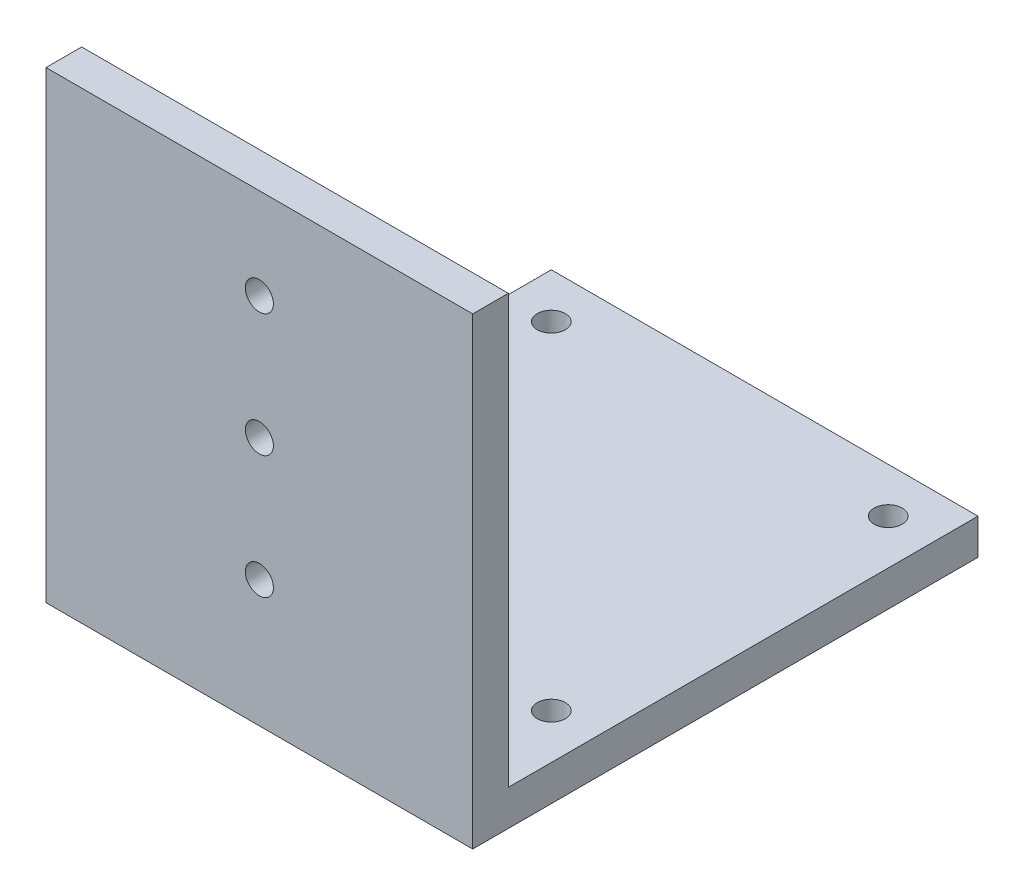
ISO-10303-21;
HEADER;
FILE_DESCRIPTION(('STEP AP214'),'2;1');
FILE_NAME('part.step','',(''),(''),'','','');
FILE_SCHEMA(('AUTOMOTIVE_DESIGN { 1 0 10303 214 1 1 1 1 }'));
ENDSEC;
DATA;
#1=APPLICATION_CONTEXT('core data for automotive mechanical design processes');
#2=APPLICATION_PROTOCOL_DEFINITION('international standard','automotive_design',2000,#1);
#3=PRODUCT_CONTEXT('',#1,'mechanical');
#4=PRODUCT('Part','Part','',(#3));
#5=PRODUCT_RELATED_PRODUCT_CATEGORY('part','',(#4));
#6=PRODUCT_DEFINITION_FORMATION('','',#4);
#7=PRODUCT_DEFINITION_CONTEXT('part definition',#1,'design');
#8=PRODUCT_DEFINITION('design','',#6,#7);
#9=PRODUCT_DEFINITION_SHAPE('','',#8);
#10=(LENGTH_UNIT() NAMED_UNIT(*) SI_UNIT(.MILLI.,.METRE.));
#11=(NAMED_UNIT(*) PLANE_ANGLE_UNIT() SI_UNIT($,.RADIAN.));
#12=(NAMED_UNIT(*) SI_UNIT($,.STERADIAN.) SOLID_ANGLE_UNIT());
#13=UNCERTAINTY_MEASURE_WITH_UNIT(LENGTH_MEASURE(1.E-05),#10,'distance_accuracy_value','');
#14=(GEOMETRIC_REPRESENTATION_CONTEXT(3) GLOBAL_UNCERTAINTY_ASSIGNED_CONTEXT((#13)) GLOBAL_UNIT_ASSIGNED_CONTEXT((#10,
#11,#12)) REPRESENTATION_CONTEXT('',''));
#15=CARTESIAN_POINT('',(0.,0.,0.));
#16=DIRECTION('',(0.,0.,1.));
#17=DIRECTION('',(1.,0.,0.));
#18=AXIS2_PLACEMENT_3D('',#15,#16,#17);
#19=CARTESIAN_POINT('',(0.,3.175,0.));
#20=DIRECTION('',(1.,0.,0.));
#21=DIRECTION('',(0.,0.,-1.));
#22=AXIS2_PLACEMENT_3D('',#19,#20,#21);
#23=PLANE('',#22);
#24=DIRECTION('',(0.,0.,1.));
#25=VECTOR('',#24,1.);
#26=CARTESIAN_POINT('',(0.,0.,0.));
#27=LINE('',#26,#25);
#28=CARTESIAN_POINT('',(0.,0.,0.));
#29=VERTEX_POINT('',#28);
#30=CARTESIAN_POINT('',(0.,0.,45.));
#31=VERTEX_POINT('',#30);
#32=EDGE_CURVE('E98',#29,#31,#27,.T.);
#33=ORIENTED_EDGE('',*,*,#32,.T.);
#34=DIRECTION('',(0.,-1.,0.));
#35=VECTOR('',#34,1.);
#36=CARTESIAN_POINT('',(0.,3.175,45.));
#37=LINE('',#36,#35);
#38=CARTESIAN_POINT('',(0.,41.275,45.));
#39=VERTEX_POINT('',#38);
#40=EDGE_CURVE('E11',#39,#31,#37,.T.);
#41=ORIENTED_EDGE('',*,*,#40,.F.);
#42=DIRECTION('',(0.,0.,1.));
#43=VECTOR('',#42,1.);
#44=CARTESIAN_POINT('',(0.,41.275,45.));
#45=LINE('',#44,#43);
#46=CARTESIAN_POINT('',(0.,41.275,41.825));
#47=VERTEX_POINT('',#46);
#48=EDGE_CURVE('E174',#47,#39,#45,.T.);
#49=ORIENTED_EDGE('',*,*,#48,.F.);
#50=DIRECTION('',(0.,-1.,0.));
#51=VECTOR('',#50,1.);
#52=CARTESIAN_POINT('',(0.,41.275,41.825));
#53=LINE('',#52,#51);
#54=CARTESIAN_POINT('',(0.,3.175,41.825));
#55=VERTEX_POINT('',#54);
#56=EDGE_CURVE('E111',#47,#55,#53,.T.);
#57=ORIENTED_EDGE('',*,*,#56,.T.);
#58=DIRECTION('',(0.,0.,1.));
#59=VECTOR('',#58,1.);
#60=CARTESIAN_POINT('',(0.,3.175,0.));
#61=LINE('',#60,#59);
#62=CARTESIAN_POINT('',(0.,3.175,0.));
#63=VERTEX_POINT('',#62);
#64=EDGE_CURVE('E92',#63,#55,#61,.T.);
#65=ORIENTED_EDGE('',*,*,#64,.F.);
#66=DIRECTION('',(0.,-1.,0.));
#67=VECTOR('',#66,1.);
#68=CARTESIAN_POINT('',(0.,3.175,0.));
#69=LINE('',#68,#67);
#70=EDGE_CURVE('E84',#63,#29,#69,.T.);
#71=ORIENTED_EDGE('',*,*,#70,.T.);
#72=EDGE_LOOP('',(#33,#41,#49,#57,#65,#71));
#73=FACE_BOUND('',#72,.T.);
#74=ADVANCED_FACE('F39',(#73),#23,.F.);
#75=CARTESIAN_POINT('',(0.,3.175,45.));
#76=DIRECTION('',(0.,0.,-1.));
#77=DIRECTION('',(-1.,0.,0.));
#78=AXIS2_PLACEMENT_3D('',#75,#76,#77);
#79=PLANE('',#78);
#80=CARTESIAN_POINT('',(19.,11.28125,45.));
#81=DIRECTION('',(0.,0.,1.));
#82=DIRECTION('',(1.,0.,0.));
#83=AXIS2_PLACEMENT_3D('',#80,#81,#82);
#84=CIRCLE('',#83,1.25);
#85=CARTESIAN_POINT('',(20.25,11.28125,45.));
#86=VERTEX_POINT('',#85);
#87=EDGE_CURVE('E127',#86,#86,#84,.T.);
#88=ORIENTED_EDGE('',*,*,#87,.F.);
#89=EDGE_LOOP('',(#88));
#90=FACE_BOUND('',#89,.T.);
#91=CARTESIAN_POINT('',(19.,33.16875,45.));
#92=DIRECTION('',(0.,0.,1.));
#93=DIRECTION('',(1.,0.,0.));
#94=AXIS2_PLACEMENT_3D('',#91,#92,#93);
#95=CIRCLE('',#94,1.25);
#96=CARTESIAN_POINT('',(20.25,33.16875,45.));
#97=VERTEX_POINT('',#96);
#98=EDGE_CURVE('E294',#97,#97,#95,.T.);
#99=ORIENTED_EDGE('',*,*,#98,.F.);
#100=EDGE_LOOP('',(#99));
#101=FACE_BOUND('',#100,.T.);
#102=CARTESIAN_POINT('',(19.,22.225,45.));
#103=DIRECTION('',(0.,0.,1.));
#104=DIRECTION('',(1.,0.,0.));
#105=AXIS2_PLACEMENT_3D('',#102,#103,#104);
#106=CIRCLE('',#105,1.25);
#107=CARTESIAN_POINT('',(20.25,22.225,45.));
#108=VERTEX_POINT('',#107);
#109=EDGE_CURVE('E149',#108,#108,#106,.T.);
#110=ORIENTED_EDGE('',*,*,#109,.F.);
#111=EDGE_LOOP('',(#110));
#112=FACE_BOUND('',#111,.T.);
#113=DIRECTION('',(1.,0.,0.));
#114=VECTOR('',#113,1.);
#115=CARTESIAN_POINT('',(0.,0.,45.));
#116=LINE('',#115,#114);
#117=CARTESIAN_POINT('',(38.,0.,45.));
#118=VERTEX_POINT('',#117);
#119=EDGE_CURVE('E103',#31,#118,#116,.T.);
#120=ORIENTED_EDGE('',*,*,#119,.T.);
#121=DIRECTION('',(0.,-1.,0.));
#122=VECTOR('',#121,1.);
#123=CARTESIAN_POINT('',(38.,3.175,45.));
#124=LINE('',#123,#122);
#125=CARTESIAN_POINT('',(38.,41.275,45.));
#126=VERTEX_POINT('',#125);
#127=EDGE_CURVE('E48',#126,#118,#124,.T.);
#128=ORIENTED_EDGE('',*,*,#127,.F.);
#129=DIRECTION('',(1.,0.,0.));
#130=VECTOR('',#129,1.);
#131=CARTESIAN_POINT('',(0.,41.275,45.));
#132=LINE('',#131,#130);
#133=EDGE_CURVE('E178',#39,#126,#132,.T.);
#134=ORIENTED_EDGE('',*,*,#133,.F.);
#135=ORIENTED_EDGE('',*,*,#40,.T.);
#136=EDGE_LOOP('',(#120,#128,#134,#135));
#137=FACE_BOUND('',#136,.T.);
#138=ADVANCED_FACE('F207',(#90,#101,#112,#137),#79,.F.);
#139=CARTESIAN_POINT('',(38.,3.175,0.));
#140=DIRECTION('',(-1.,0.,0.));
#141=DIRECTION('',(0.,0.,1.));
#142=AXIS2_PLACEMENT_3D('',#139,#140,#141);
#143=PLANE('',#142);
#144=DIRECTION('',(0.,0.,-1.));
#145=VECTOR('',#144,1.);
#146=CARTESIAN_POINT('',(38.,0.,0.));
#147=LINE('',#146,#145);
#148=CARTESIAN_POINT('',(38.,0.,0.));
#149=VERTEX_POINT('',#148);
#150=EDGE_CURVE('E93',#118,#149,#147,.T.);
#151=ORIENTED_EDGE('',*,*,#150,.T.);
#152=DIRECTION('',(0.,-1.,0.));
#153=VECTOR('',#152,1.);
#154=CARTESIAN_POINT('',(38.,3.175,0.));
#155=LINE('',#154,#153);
#156=CARTESIAN_POINT('',(38.,3.175,0.));
#157=VERTEX_POINT('',#156);
#158=EDGE_CURVE('E87',#157,#149,#155,.T.);
#159=ORIENTED_EDGE('',*,*,#158,.F.);
#160=DIRECTION('',(0.,0.,-1.));
#161=VECTOR('',#160,1.);
#162=CARTESIAN_POINT('',(38.,3.175,0.));
#163=LINE('',#162,#161);
#164=CARTESIAN_POINT('',(38.,3.175,41.825));
#165=VERTEX_POINT('',#164);
#166=EDGE_CURVE('E195',#165,#157,#163,.T.);
#167=ORIENTED_EDGE('',*,*,#166,.F.);
#168=DIRECTION('',(0.,-1.,0.));
#169=VECTOR('',#168,1.);
#170=CARTESIAN_POINT('',(38.,41.275,41.825));
#171=LINE('',#170,#169);
#172=CARTESIAN_POINT('',(38.,41.275,41.825));
#173=VERTEX_POINT('',#172);
#174=EDGE_CURVE('E105',#173,#165,#171,.T.);
#175=ORIENTED_EDGE('',*,*,#174,.F.);
#176=DIRECTION('',(0.,0.,-1.));
#177=VECTOR('',#176,1.);
#178=CARTESIAN_POINT('',(38.,41.275,45.));
#179=LINE('',#178,#177);
#180=EDGE_CURVE('E182',#126,#173,#179,.T.);
#181=ORIENTED_EDGE('',*,*,#180,.F.);
#182=ORIENTED_EDGE('',*,*,#127,.T.);
#183=EDGE_LOOP('',(#151,#159,#167,#175,#181,#182));
#184=FACE_BOUND('',#183,.T.);
#185=ADVANCED_FACE('F201',(#184),#143,.F.);
#186=CARTESIAN_POINT('',(0.,3.175,0.));
#187=DIRECTION('',(0.,0.,1.));
#188=DIRECTION('',(1.,0.,0.));
#189=AXIS2_PLACEMENT_3D('',#186,#187,#188);
#190=PLANE('',#189);
#191=DIRECTION('',(-1.,0.,0.));
#192=VECTOR('',#191,1.);
#193=CARTESIAN_POINT('',(0.,0.,0.));
#194=LINE('',#193,#192);
#195=EDGE_CURVE('E81',#149,#29,#194,.T.);
#196=ORIENTED_EDGE('',*,*,#195,.T.);
#197=ORIENTED_EDGE('',*,*,#70,.F.);
#198=DIRECTION('',(-1.,0.,0.));
#199=VECTOR('',#198,1.);
#200=CARTESIAN_POINT('',(0.,3.175,0.));
#201=LINE('',#200,#199);
#202=EDGE_CURVE('E62',#157,#63,#201,.T.);
#203=ORIENTED_EDGE('',*,*,#202,.F.);
#204=ORIENTED_EDGE('',*,*,#158,.T.);
#205=EDGE_LOOP('',(#196,#197,#203,#204));
#206=FACE_BOUND('',#205,.T.);
#207=ADVANCED_FACE('F83',(#206),#190,.F.);
#208=CARTESIAN_POINT('',(0.,3.175,0.));
#209=DIRECTION('',(0.,1.,0.));
#210=DIRECTION('',(0.,0.,1.));
#211=AXIS2_PLACEMENT_3D('',#208,#209,#210);
#212=PLANE('',#211);
#213=CARTESIAN_POINT('',(34.,3.175,34.));
#214=DIRECTION('',(0.,1.,0.));
#215=DIRECTION('',(0.,0.,1.));
#216=AXIS2_PLACEMENT_3D('',#213,#214,#215);
#217=CIRCLE('',#216,1.25);
#218=CARTESIAN_POINT('',(34.,3.175,35.25));
#219=VERTEX_POINT('',#218);
#220=EDGE_CURVE('E170',#219,#219,#217,.T.);
#221=ORIENTED_EDGE('',*,*,#220,.F.);
#222=EDGE_LOOP('',(#221));
#223=FACE_BOUND('',#222,.T.);
#224=CARTESIAN_POINT('',(4.,3.175,4.));
#225=DIRECTION('',(0.,1.,0.));
#226=DIRECTION('',(0.,0.,1.));
#227=AXIS2_PLACEMENT_3D('',#224,#225,#226);
#228=CIRCLE('',#227,1.25);
#229=CARTESIAN_POINT('',(4.,3.175,5.25));
#230=VERTEX_POINT('',#229);
#231=EDGE_CURVE('E166',#230,#230,#228,.T.);
#232=ORIENTED_EDGE('',*,*,#231,.F.);
#233=EDGE_LOOP('',(#232));
#234=FACE_BOUND('',#233,.T.);
#235=CARTESIAN_POINT('',(34.,3.175,4.));
#236=DIRECTION('',(0.,1.,0.));
#237=DIRECTION('',(0.,0.,1.));
#238=AXIS2_PLACEMENT_3D('',#235,#236,#237);
#239=CIRCLE('',#238,1.25);
#240=CARTESIAN_POINT('',(34.,3.175,5.25));
#241=VERTEX_POINT('',#240);
#242=EDGE_CURVE('E162',#241,#241,#239,.T.);
#243=ORIENTED_EDGE('',*,*,#242,.F.);
#244=EDGE_LOOP('',(#243));
#245=FACE_BOUND('',#244,.T.);
#246=CARTESIAN_POINT('',(4.,3.175,34.));
#247=DIRECTION('',(0.,1.,0.));
#248=DIRECTION('',(0.,0.,1.));
#249=AXIS2_PLACEMENT_3D('',#246,#247,#248);
#250=CIRCLE('',#249,1.25);
#251=CARTESIAN_POINT('',(4.,3.175,35.25));
#252=VERTEX_POINT('',#251);
#253=EDGE_CURVE('E158',#252,#252,#250,.T.);
#254=ORIENTED_EDGE('',*,*,#253,.F.);
#255=EDGE_LOOP('',(#254));
#256=FACE_BOUND('',#255,.T.);
#257=DIRECTION('',(-1.,0.,0.));
#258=VECTOR('',#257,1.);
#259=CARTESIAN_POINT('',(0.,3.175,41.825));
#260=LINE('',#259,#258);
#261=EDGE_CURVE('E56',#165,#55,#260,.T.);
#262=ORIENTED_EDGE('',*,*,#261,.F.);
#263=ORIENTED_EDGE('',*,*,#166,.T.);
#264=ORIENTED_EDGE('',*,*,#202,.T.);
#265=ORIENTED_EDGE('',*,*,#64,.T.);
#266=EDGE_LOOP('',(#262,#263,#264,#265));
#267=FACE_BOUND('',#266,.T.);
#268=ADVANCED_FACE('F198',(#223,#234,#245,#256,#267),#212,.T.);
#269=CARTESIAN_POINT('',(0.,0.,0.));
#270=DIRECTION('',(0.,1.,0.));
#271=DIRECTION('',(0.,0.,1.));
#272=AXIS2_PLACEMENT_3D('',#269,#270,#271);
#273=PLANE('',#272);
#274=CARTESIAN_POINT('',(34.,0.,34.));
#275=DIRECTION('',(0.,-1.,0.));
#276=DIRECTION('',(0.,0.,-1.));
#277=AXIS2_PLACEMENT_3D('',#274,#275,#276);
#278=CIRCLE('',#277,1.25);
#279=CARTESIAN_POINT('',(34.,0.,32.75));
#280=VERTEX_POINT('',#279);
#281=EDGE_CURVE('E145',#280,#280,#278,.T.);
#282=ORIENTED_EDGE('',*,*,#281,.F.);
#283=EDGE_LOOP('',(#282));
#284=FACE_BOUND('',#283,.T.);
#285=CARTESIAN_POINT('',(4.,0.,4.));
#286=DIRECTION('',(0.,-1.,0.));
#287=DIRECTION('',(0.,0.,-1.));
#288=AXIS2_PLACEMENT_3D('',#285,#286,#287);
#289=CIRCLE('',#288,1.25);
#290=CARTESIAN_POINT('',(4.,0.,2.75));
#291=VERTEX_POINT('',#290);
#292=EDGE_CURVE('E139',#291,#291,#289,.T.);
#293=ORIENTED_EDGE('',*,*,#292,.F.);
#294=EDGE_LOOP('',(#293));
#295=FACE_BOUND('',#294,.T.);
#296=CARTESIAN_POINT('',(34.,0.,4.));
#297=DIRECTION('',(0.,-1.,0.));
#298=DIRECTION('',(0.,0.,-1.));
#299=AXIS2_PLACEMENT_3D('',#296,#297,#298);
#300=CIRCLE('',#299,1.25);
#301=CARTESIAN_POINT('',(34.,0.,2.75000000000001));
#302=VERTEX_POINT('',#301);
#303=EDGE_CURVE('E134',#302,#302,#300,.T.);
#304=ORIENTED_EDGE('',*,*,#303,.F.);
#305=EDGE_LOOP('',(#304));
#306=FACE_BOUND('',#305,.T.);
#307=CARTESIAN_POINT('',(4.,0.,34.));
#308=DIRECTION('',(0.,-1.,0.));
#309=DIRECTION('',(0.,0.,-1.));
#310=AXIS2_PLACEMENT_3D('',#307,#308,#309);
#311=CIRCLE('',#310,1.25);
#312=CARTESIAN_POINT('',(4.,0.,32.75));
#313=VERTEX_POINT('',#312);
#314=EDGE_CURVE('E153',#313,#313,#311,.T.);
#315=ORIENTED_EDGE('',*,*,#314,.F.);
#316=EDGE_LOOP('',(#315));
#317=FACE_BOUND('',#316,.T.);
#318=ORIENTED_EDGE('',*,*,#32,.F.);
#319=ORIENTED_EDGE('',*,*,#195,.F.);
#320=ORIENTED_EDGE('',*,*,#150,.F.);
#321=ORIENTED_EDGE('',*,*,#119,.F.);
#322=EDGE_LOOP('',(#318,#319,#320,#321));
#323=FACE_BOUND('',#322,.T.);
#324=ADVANCED_FACE('F102',(#284,#295,#306,#317,#323),#273,.F.);
#325=CARTESIAN_POINT('',(0.,41.275,41.825));
#326=DIRECTION('',(0.,0.,1.));
#327=DIRECTION('',(1.,0.,0.));
#328=AXIS2_PLACEMENT_3D('',#325,#326,#327);
#329=PLANE('',#328);
#330=CARTESIAN_POINT('',(19.,11.28125,41.825));
#331=DIRECTION('',(0.,0.,1.));
#332=DIRECTION('',(1.,0.,0.));
#333=AXIS2_PLACEMENT_3D('',#330,#331,#332);
#334=CIRCLE('',#333,1.25);
#335=CARTESIAN_POINT('',(20.25,11.28125,41.825));
#336=VERTEX_POINT('',#335);
#337=EDGE_CURVE('E42',#336,#336,#334,.T.);
#338=ORIENTED_EDGE('',*,*,#337,.T.);
#339=EDGE_LOOP('',(#338));
#340=FACE_BOUND('',#339,.T.);
#341=CARTESIAN_POINT('',(19.,33.16875,41.825));
#342=DIRECTION('',(0.,0.,1.));
#343=DIRECTION('',(1.,0.,0.));
#344=AXIS2_PLACEMENT_3D('',#341,#342,#343);
#345=CIRCLE('',#344,1.25);
#346=CARTESIAN_POINT('',(20.25,33.16875,41.825));
#347=VERTEX_POINT('',#346);
#348=EDGE_CURVE('E126',#347,#347,#345,.T.);
#349=ORIENTED_EDGE('',*,*,#348,.T.);
#350=EDGE_LOOP('',(#349));
#351=FACE_BOUND('',#350,.T.);
#352=CARTESIAN_POINT('',(19.,22.225,41.825));
#353=DIRECTION('',(0.,0.,1.));
#354=DIRECTION('',(1.,0.,0.));
#355=AXIS2_PLACEMENT_3D('',#352,#353,#354);
#356=CIRCLE('',#355,1.25);
#357=CARTESIAN_POINT('',(20.25,22.225,41.825));
#358=VERTEX_POINT('',#357);
#359=EDGE_CURVE('E123',#358,#358,#356,.T.);
#360=ORIENTED_EDGE('',*,*,#359,.T.);
#361=EDGE_LOOP('',(#360));
#362=FACE_BOUND('',#361,.T.);
#363=ORIENTED_EDGE('',*,*,#261,.T.);
#364=ORIENTED_EDGE('',*,*,#56,.F.);
#365=DIRECTION('',(-1.,0.,0.));
#366=VECTOR('',#365,1.);
#367=CARTESIAN_POINT('',(0.,41.275,41.825));
#368=LINE('',#367,#366);
#369=EDGE_CURVE('E186',#173,#47,#368,.T.);
#370=ORIENTED_EDGE('',*,*,#369,.F.);
#371=ORIENTED_EDGE('',*,*,#174,.T.);
#372=EDGE_LOOP('',(#363,#364,#370,#371));
#373=FACE_BOUND('',#372,.T.);
#374=ADVANCED_FACE('F221',(#340,#351,#362,#373),#329,.F.);
#375=CARTESIAN_POINT('',(0.,41.275,0.));
#376=DIRECTION('',(0.,-1.,0.));
#377=DIRECTION('',(0.,0.,-1.));
#378=AXIS2_PLACEMENT_3D('',#375,#376,#377);
#379=PLANE('',#378);
#380=ORIENTED_EDGE('',*,*,#48,.T.);
#381=ORIENTED_EDGE('',*,*,#133,.T.);
#382=ORIENTED_EDGE('',*,*,#180,.T.);
#383=ORIENTED_EDGE('',*,*,#369,.T.);
#384=EDGE_LOOP('',(#380,#381,#382,#383));
#385=FACE_BOUND('',#384,.T.);
#386=ADVANCED_FACE('F212',(#385),#379,.F.);
#387=CARTESIAN_POINT('',(4.,10.,34.));
#388=DIRECTION('',(0.,-1.,0.));
#389=DIRECTION('',(0.,0.,-1.));
#390=AXIS2_PLACEMENT_3D('',#387,#388,#389);
#391=CYLINDRICAL_SURFACE('',#390,1.25);
#392=ORIENTED_EDGE('',*,*,#253,.T.);
#393=EDGE_LOOP('',(#392));
#394=FACE_BOUND('',#393,.T.);
#395=ORIENTED_EDGE('',*,*,#314,.T.);
#396=EDGE_LOOP('',(#395));
#397=FACE_BOUND('',#396,.T.);
#398=ADVANCED_FACE('F228',(#394,#397),#391,.F.);
#399=CARTESIAN_POINT('',(34.,10.,4.));
#400=DIRECTION('',(0.,-1.,0.));
#401=DIRECTION('',(0.,0.,-1.));
#402=AXIS2_PLACEMENT_3D('',#399,#400,#401);
#403=CYLINDRICAL_SURFACE('',#402,1.25);
#404=ORIENTED_EDGE('',*,*,#242,.T.);
#405=EDGE_LOOP('',(#404));
#406=FACE_BOUND('',#405,.T.);
#407=ORIENTED_EDGE('',*,*,#303,.T.);
#408=EDGE_LOOP('',(#407));
#409=FACE_BOUND('',#408,.T.);
#410=ADVANCED_FACE('F260',(#406,#409),#403,.F.);
#411=CARTESIAN_POINT('',(4.,10.,4.));
#412=DIRECTION('',(0.,-1.,0.));
#413=DIRECTION('',(0.,0.,-1.));
#414=AXIS2_PLACEMENT_3D('',#411,#412,#413);
#415=CYLINDRICAL_SURFACE('',#414,1.25);
#416=ORIENTED_EDGE('',*,*,#231,.T.);
#417=EDGE_LOOP('',(#416));
#418=FACE_BOUND('',#417,.T.);
#419=ORIENTED_EDGE('',*,*,#292,.T.);
#420=EDGE_LOOP('',(#419));
#421=FACE_BOUND('',#420,.T.);
#422=ADVANCED_FACE('F267',(#418,#421),#415,.F.);
#423=CARTESIAN_POINT('',(34.,10.,34.));
#424=DIRECTION('',(0.,-1.,0.));
#425=DIRECTION('',(0.,0.,-1.));
#426=AXIS2_PLACEMENT_3D('',#423,#424,#425);
#427=CYLINDRICAL_SURFACE('',#426,1.25);
#428=ORIENTED_EDGE('',*,*,#220,.T.);
#429=EDGE_LOOP('',(#428));
#430=FACE_BOUND('',#429,.T.);
#431=ORIENTED_EDGE('',*,*,#281,.T.);
#432=EDGE_LOOP('',(#431));
#433=FACE_BOUND('',#432,.T.);
#434=ADVANCED_FACE('F273',(#430,#433),#427,.F.);
#435=CARTESIAN_POINT('',(19.,22.225,35.));
#436=DIRECTION('',(0.,0.,1.));
#437=DIRECTION('',(1.,0.,0.));
#438=AXIS2_PLACEMENT_3D('',#435,#436,#437);
#439=CYLINDRICAL_SURFACE('',#438,1.25);
#440=ORIENTED_EDGE('',*,*,#109,.T.);
#441=EDGE_LOOP('',(#440));
#442=FACE_BOUND('',#441,.T.);
#443=ORIENTED_EDGE('',*,*,#359,.F.);
#444=EDGE_LOOP('',(#443));
#445=FACE_BOUND('',#444,.T.);
#446=ADVANCED_FACE('F276',(#442,#445),#439,.F.);
#447=CARTESIAN_POINT('',(19.,33.16875,35.));
#448=DIRECTION('',(0.,0.,1.));
#449=DIRECTION('',(1.,0.,0.));
#450=AXIS2_PLACEMENT_3D('',#447,#448,#449);
#451=CYLINDRICAL_SURFACE('',#450,1.25);
#452=ORIENTED_EDGE('',*,*,#98,.T.);
#453=EDGE_LOOP('',(#452));
#454=FACE_BOUND('',#453,.T.);
#455=ORIENTED_EDGE('',*,*,#348,.F.);
#456=EDGE_LOOP('',(#455));
#457=FACE_BOUND('',#456,.T.);
#458=ADVANCED_FACE('F281',(#454,#457),#451,.F.);
#459=CARTESIAN_POINT('',(19.,11.28125,35.));
#460=DIRECTION('',(0.,0.,1.));
#461=DIRECTION('',(1.,0.,0.));
#462=AXIS2_PLACEMENT_3D('',#459,#460,#461);
#463=CYLINDRICAL_SURFACE('',#462,1.25);
#464=ORIENTED_EDGE('',*,*,#87,.T.);
#465=EDGE_LOOP('',(#464));
#466=FACE_BOUND('',#465,.T.);
#467=ORIENTED_EDGE('',*,*,#337,.F.);
#468=EDGE_LOOP('',(#467));
#469=FACE_BOUND('',#468,.T.);
#470=ADVANCED_FACE('F285',(#466,#469),#463,.F.);
#471=CLOSED_SHELL('',(#74,#138,#185,#207,#268,#324,#374,#386,#398,#410,#422,#434,#446,#458,#470));
#472=MANIFOLD_SOLID_BREP('B2',#471);
#473=ADVANCED_BREP_SHAPE_REPRESENTATION('',(#18,#472),#14);
#474=SHAPE_DEFINITION_REPRESENTATION(#9,#473);
ENDSEC;
END-ISO-10303-21;
